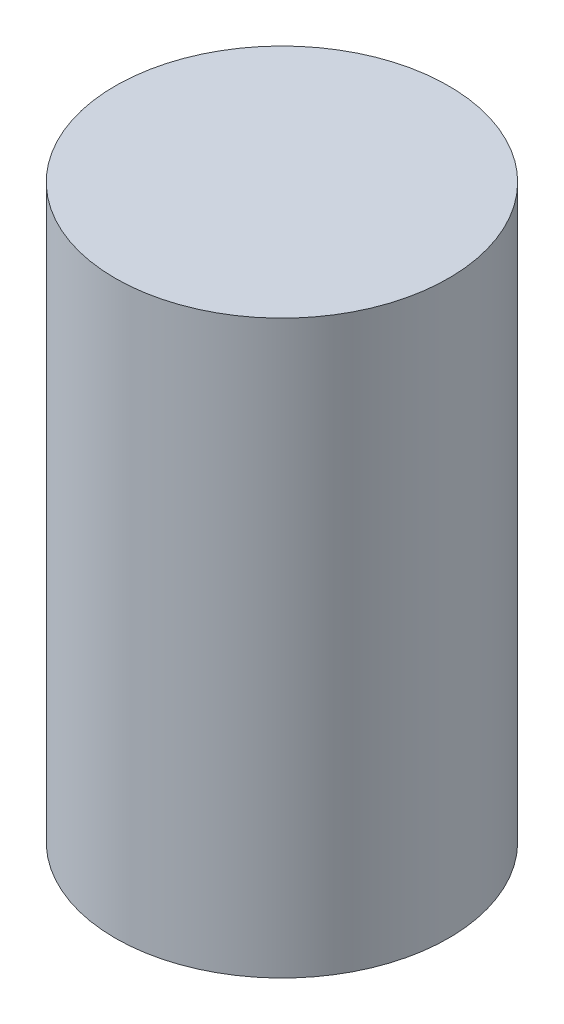
ISO-10303-21;
HEADER;
FILE_DESCRIPTION(('STEP AP214'),'2;1');
FILE_NAME('part.step','',(''),(''),'','','');
FILE_SCHEMA(('AUTOMOTIVE_DESIGN { 1 0 10303 214 1 1 1 1 }'));
ENDSEC;
DATA;
#1=APPLICATION_CONTEXT('core data for automotive mechanical design processes');
#2=APPLICATION_PROTOCOL_DEFINITION('international standard','automotive_design',2000,#1);
#3=PRODUCT_CONTEXT('',#1,'mechanical');
#4=PRODUCT('Part','Part','',(#3));
#5=PRODUCT_RELATED_PRODUCT_CATEGORY('part','',(#4));
#6=PRODUCT_DEFINITION_FORMATION('','',#4);
#7=PRODUCT_DEFINITION_CONTEXT('part definition',#1,'design');
#8=PRODUCT_DEFINITION('design','',#6,#7);
#9=PRODUCT_DEFINITION_SHAPE('','',#8);
#10=(LENGTH_UNIT() NAMED_UNIT(*) SI_UNIT(.MILLI.,.METRE.));
#11=(NAMED_UNIT(*) PLANE_ANGLE_UNIT() SI_UNIT($,.RADIAN.));
#12=(NAMED_UNIT(*) SI_UNIT($,.STERADIAN.) SOLID_ANGLE_UNIT());
#13=UNCERTAINTY_MEASURE_WITH_UNIT(LENGTH_MEASURE(1.E-05),#10,'distance_accuracy_value','');
#14=(GEOMETRIC_REPRESENTATION_CONTEXT(3) GLOBAL_UNCERTAINTY_ASSIGNED_CONTEXT((#13)) GLOBAL_UNIT_ASSIGNED_CONTEXT((#10,
#11,#12)) REPRESENTATION_CONTEXT('',''));
#15=CARTESIAN_POINT('',(0.,0.,0.));
#16=DIRECTION('',(0.,0.,1.));
#17=DIRECTION('',(1.,0.,0.));
#18=AXIS2_PLACEMENT_3D('',#15,#16,#17);
#19=CARTESIAN_POINT('',(0.,76.2,0.));
#20=DIRECTION('',(0.,-1.,0.));
#21=DIRECTION('',(0.,0.,-1.));
#22=AXIS2_PLACEMENT_3D('',#19,#20,#21);
#23=CYLINDRICAL_SURFACE('',#22,44.45);
#24=CARTESIAN_POINT('',(0.,76.2,0.));
#25=DIRECTION('',(0.,1.,0.));
#26=DIRECTION('',(0.,0.,1.));
#27=AXIS2_PLACEMENT_3D('',#24,#25,#26);
#28=CIRCLE('',#27,44.45);
#29=CARTESIAN_POINT('',(0.,76.2,44.45));
#30=VERTEX_POINT('',#29);
#31=EDGE_CURVE('E10',#30,#30,#28,.T.);
#32=ORIENTED_EDGE('',*,*,#31,.F.);
#33=EDGE_LOOP('',(#32));
#34=FACE_BOUND('',#33,.T.);
#35=CARTESIAN_POINT('',(0.,-76.2,0.));
#36=DIRECTION('',(0.,1.,0.));
#37=DIRECTION('',(0.,0.,1.));
#38=AXIS2_PLACEMENT_3D('',#35,#36,#37);
#39=CIRCLE('',#38,44.45);
#40=CARTESIAN_POINT('',(0.,-76.2,44.45));
#41=VERTEX_POINT('',#40);
#42=EDGE_CURVE('E34',#41,#41,#39,.T.);
#43=ORIENTED_EDGE('',*,*,#42,.T.);
#44=EDGE_LOOP('',(#43));
#45=FACE_BOUND('',#44,.T.);
#46=ADVANCED_FACE('F31',(#34,#45),#23,.T.);
#47=CARTESIAN_POINT('',(0.,76.2,0.));
#48=DIRECTION('',(0.,1.,0.));
#49=DIRECTION('',(0.,0.,1.));
#50=AXIS2_PLACEMENT_3D('',#47,#48,#49);
#51=PLANE('',#50);
#52=ORIENTED_EDGE('',*,*,#31,.T.);
#53=EDGE_LOOP('',(#52));
#54=FACE_BOUND('',#53,.T.);
#55=ADVANCED_FACE('F46',(#54),#51,.T.);
#56=CARTESIAN_POINT('',(0.,-76.2,0.));
#57=DIRECTION('',(0.,1.,0.));
#58=DIRECTION('',(0.,0.,1.));
#59=AXIS2_PLACEMENT_3D('',#56,#57,#58);
#60=PLANE('',#59);
#61=ORIENTED_EDGE('',*,*,#42,.F.);
#62=EDGE_LOOP('',(#61));
#63=FACE_BOUND('',#62,.T.);
#64=ADVANCED_FACE('F44',(#63),#60,.F.);
#65=CLOSED_SHELL('',(#46,#55,#64));
#66=MANIFOLD_SOLID_BREP('B2',#65);
#67=ADVANCED_BREP_SHAPE_REPRESENTATION('',(#18,#66),#14);
#68=SHAPE_DEFINITION_REPRESENTATION(#9,#67);
ENDSEC;
END-ISO-10303-21;
